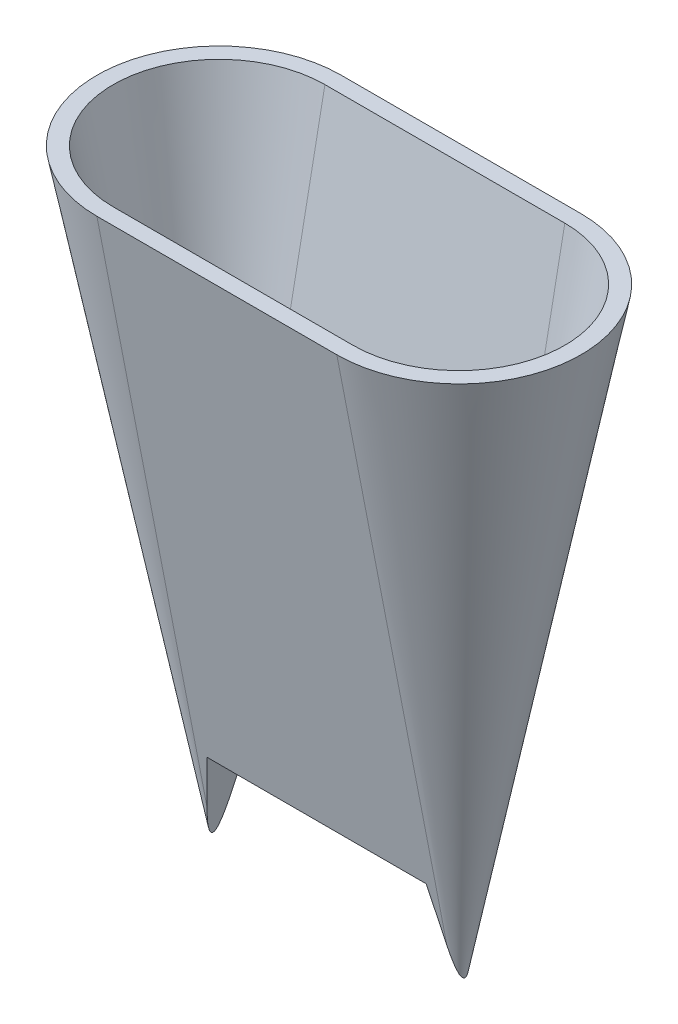
ISO-10303-21;
HEADER;
FILE_DESCRIPTION(('STEP AP214'),'2;1');
FILE_NAME('part.step','',(''),(''),'','','');
FILE_SCHEMA(('AUTOMOTIVE_DESIGN { 1 0 10303 214 1 1 1 1 }'));
ENDSEC;
DATA;
#1=APPLICATION_CONTEXT('core data for automotive mechanical design processes');
#2=APPLICATION_PROTOCOL_DEFINITION('international standard','automotive_design',2000,#1);
#3=PRODUCT_CONTEXT('',#1,'mechanical');
#4=PRODUCT('Part','Part','',(#3));
#5=PRODUCT_RELATED_PRODUCT_CATEGORY('part','',(#4));
#6=PRODUCT_DEFINITION_FORMATION('','',#4);
#7=PRODUCT_DEFINITION_CONTEXT('part definition',#1,'design');
#8=PRODUCT_DEFINITION('design','',#6,#7);
#9=PRODUCT_DEFINITION_SHAPE('','',#8);
#10=(LENGTH_UNIT() NAMED_UNIT(*) SI_UNIT(.MILLI.,.METRE.));
#11=(NAMED_UNIT(*) PLANE_ANGLE_UNIT() SI_UNIT($,.RADIAN.));
#12=(NAMED_UNIT(*) SI_UNIT($,.STERADIAN.) SOLID_ANGLE_UNIT());
#13=UNCERTAINTY_MEASURE_WITH_UNIT(LENGTH_MEASURE(1.E-05),#10,'distance_accuracy_value','');
#14=(GEOMETRIC_REPRESENTATION_CONTEXT(3) GLOBAL_UNCERTAINTY_ASSIGNED_CONTEXT((#13)) GLOBAL_UNIT_ASSIGNED_CONTEXT((#10,
#11,#12)) REPRESENTATION_CONTEXT('',''));
#15=CARTESIAN_POINT('',(0.,0.,0.));
#16=DIRECTION('',(0.,0.,1.));
#17=DIRECTION('',(1.,0.,0.));
#18=AXIS2_PLACEMENT_3D('',#15,#16,#17);
#19=CARTESIAN_POINT('',(-15.,0.,0.));
#20=DIRECTION('',(0.,1.,0.));
#21=DIRECTION('',(0.,0.,1.));
#22=AXIS2_PLACEMENT_3D('',#19,#20,#21);
#23=CONICAL_SURFACE('',#22,7.5,0.191986217719377);
#24=DIRECTION('',(0.,0.981627183447664,-0.190808995376545));
#25=VECTOR('',#24,1.);
#26=CARTESIAN_POINT('',(-15.,0.,-7.5));
#27=LINE('',#26,#25);
#28=CARTESIAN_POINT('',(-15.,40.,-15.2752123655088));
#29=VERTEX_POINT('',#28);
#30=CARTESIAN_POINT('',(-15.,-30.8613850399258,-1.50115443552106));
#31=VERTEX_POINT('',#30);
#32=EDGE_CURVE('E343',#29,#31,#27,.F.);
#33=ORIENTED_EDGE('',*,*,#32,.T.);
#34=CARTESIAN_POINT('',(-14.9998,-30.8603561291226,1.50135442219976));
#35=CARTESIAN_POINT('',(-15.0190712352747,-30.9594980399477,1.48208314362833));
#36=CARTESIAN_POINT('',(-15.038329698687,-31.0585742452367,1.46245909004408));
#37=CARTESIAN_POINT('',(-15.0768168852861,-31.2565736556185,1.42240612971769));
#38=CARTESIAN_POINT('',(-15.0960456072818,-31.3554968545836,1.40197719156499));
#39=CARTESIAN_POINT('',(-15.1537519332705,-31.6523701656958,1.3392566820495));
#40=CARTESIAN_POINT('',(-15.1921761017825,-31.8500453761247,1.29560421439981));
#41=CARTESIAN_POINT('',(-15.2705156890329,-32.2530676143232,1.20150956510338));
#42=CARTESIAN_POINT('',(-15.3104218973465,-32.458367258565,1.15085247219537));
#43=CARTESIAN_POINT('',(-15.3699794504313,-32.7647643074688,1.06929859383519));
#44=CARTESIAN_POINT('',(-15.389770283974,-32.8665793196499,1.04120383318318));
#45=CARTESIAN_POINT('',(-15.4292252524226,-33.0695575360325,0.982679421542151));
#46=CARTESIAN_POINT('',(-15.4488893976455,-33.1707207933096,0.952249963352666));
#47=CARTESIAN_POINT('',(-15.4878158257775,-33.3709799054833,0.88875571223472));
#48=CARTESIAN_POINT('',(-15.5070801310508,-33.4700861645418,0.855725147475472));
#49=CARTESIAN_POINT('',(-15.5453914515757,-33.6671808224052,0.785667271690789));
#50=CARTESIAN_POINT('',(-15.5644379588107,-33.7651666076912,0.748632146875924));
#51=CARTESIAN_POINT('',(-15.5926189917899,-33.9101454540789,0.688931220845984));
#52=CARTESIAN_POINT('',(-15.601918726099,-33.9579884395662,0.668411780415396));
#53=CARTESIAN_POINT('',(-15.620368496395,-34.0529042794363,0.625609477526921));
#54=CARTESIAN_POINT('',(-15.6295185635435,-34.0999772941313,0.603326987933398));
#55=CARTESIAN_POINT('',(-15.647579418861,-34.1928923398867,0.556575317431299));
#56=CARTESIAN_POINT('',(-15.6564908562207,-34.2387377107436,0.532113070371359));
#57=CARTESIAN_POINT('',(-15.6739907328846,-34.3287667715142,0.480223430185622));
#58=CARTESIAN_POINT('',(-15.6825794963089,-34.3729521288805,0.452799125884259));
#59=CARTESIAN_POINT('',(-15.6951288388419,-34.4375128994064,0.40828330964859));
#60=CARTESIAN_POINT('',(-15.69928879819,-34.458914034977,0.392740645365037));
#61=CARTESIAN_POINT('',(-15.7074229136262,-34.5007604312107,0.360314772346504));
#62=CARTESIAN_POINT('',(-15.7113968804938,-34.5212047184189,0.343430243620687));
#63=CARTESIAN_POINT('',(-15.7190411823082,-34.5605312420173,0.308202174131339));
#64=CARTESIAN_POINT('',(-15.7227139513559,-34.5794260007718,0.289873309614169));
#65=CARTESIAN_POINT('',(-15.7296671646166,-34.615197181976,0.251296848263089));
#66=CARTESIAN_POINT('',(-15.7329484285443,-34.6320778214926,0.231053425333127));
#67=CARTESIAN_POINT('',(-15.7381247585097,-34.6587077306039,0.193987307835811));
#68=CARTESIAN_POINT('',(-15.7401560490138,-34.6691578143246,0.17769385359313));
#69=CARTESIAN_POINT('',(-15.7437862311934,-34.6878334826353,0.143790847653814));
#70=CARTESIAN_POINT('',(-15.7453848909728,-34.6960578742234,0.126180596564448));
#71=CARTESIAN_POINT('',(-15.7480197601323,-34.7096131009398,0.0895380092189851));
#72=CARTESIAN_POINT('',(-15.7490483280054,-34.7149046239217,0.0704900672352159));
#73=CARTESIAN_POINT('',(-15.7503664303487,-34.7216856726254,0.0317161378807902));
#74=CARTESIAN_POINT('',(-15.7506575745668,-34.7231834797821,0.0119917228442268));
#75=CARTESIAN_POINT('',(-15.7504703216314,-34.7222201469409,-0.0248433500679373));
#76=CARTESIAN_POINT('',(-15.7500846337885,-34.7202359549999,-0.0419689404773808));
#77=CARTESIAN_POINT('',(-15.7487663608822,-34.7134540288257,-0.0756375389911444));
#78=CARTESIAN_POINT('',(-15.7478330246398,-34.7086524301119,-0.0921797137538846));
#79=CARTESIAN_POINT('',(-15.7450843844251,-34.6945119020569,-0.130297181171212));
#80=CARTESIAN_POINT('',(-15.7430706248146,-34.6841520069654,-0.151473808652895));
#81=CARTESIAN_POINT('',(-15.7384451506752,-34.6603560054056,-0.191924871751388));
#82=CARTESIAN_POINT('',(-15.7358321523146,-34.6469132941961,-0.21119509426829));
#83=CARTESIAN_POINT('',(-15.7277374135341,-34.6052694732945,-0.264148433561012));
#84=CARTESIAN_POINT('',(-15.7217474818391,-34.5744539461375,-0.29567342403224));
#85=CARTESIAN_POINT('',(-15.712226123449,-34.5254708035941,-0.339635894862233));
#86=CARTESIAN_POINT('',(-15.7089547817211,-34.5086412093705,-0.353764514563684));
#87=CARTESIAN_POINT('',(-15.7022712550229,-34.4742574452543,-0.381072652388516));
#88=CARTESIAN_POINT('',(-15.6988591441411,-34.4567036565147,-0.394252660001347));
#89=CARTESIAN_POINT('',(-15.6878613542711,-34.4001249324717,-0.43482001147474));
#90=CARTESIAN_POINT('',(-15.6800779406887,-34.3600827408687,-0.460724552420414));
#91=CARTESIAN_POINT('',(-15.6642032025561,-34.278414293056,-0.509823821483274));
#92=CARTESIAN_POINT('',(-15.6561115870072,-34.2367865397883,-0.533015900022886));
#93=CARTESIAN_POINT('',(-15.6397007048295,-34.1523598699752,-0.577389918868068));
#94=CARTESIAN_POINT('',(-15.631380825778,-34.1095578027885,-0.598565592482726));
#95=CARTESIAN_POINT('',(-15.6145953177553,-34.0232038500803,-0.639274502292302));
#96=CARTESIAN_POINT('',(-15.6061296580903,-33.9796518066532,-0.658807387379938));
#97=CARTESIAN_POINT('',(-15.5803679890253,-33.8471195086062,-0.715884613524773));
#98=CARTESIAN_POINT('',(-15.5629076763217,-33.757293986767,-0.751388160349785));
#99=CARTESIAN_POINT('',(-15.5277663724267,-33.5765076506876,-0.818572942077548));
#100=CARTESIAN_POINT('',(-15.5100858836623,-33.4855494212102,-0.850261568241286));
#101=CARTESIAN_POINT('',(-15.4716328094171,-33.2877255036761,-0.915818414728786));
#102=CARTESIAN_POINT('',(-15.4508294909977,-33.1807017083557,-0.949189255077152));
#103=CARTESIAN_POINT('',(-15.4090635040704,-32.965834332578,-1.01308743902758));
#104=CARTESIAN_POINT('',(-15.3881008159618,-32.8579906512832,-1.04361442653958));
#105=CARTESIAN_POINT('',(-15.3460331719036,-32.6415713841013,-1.10246679035449));
#106=CARTESIAN_POINT('',(-15.3249280610919,-32.5329950015178,-1.13078911197033));
#107=CARTESIAN_POINT('',(-15.2826314778386,-32.3153979442801,-1.18560804098983));
#108=CARTESIAN_POINT('',(-15.2614400025552,-32.2063772550063,-1.21210458779491));
#109=CARTESIAN_POINT('',(-15.2002835212734,-31.8917544336257,-1.28627705799656));
#110=CARTESIAN_POINT('',(-15.1602338082747,-31.6857165217795,-1.33203711548439));
#111=CARTESIAN_POINT('',(-15.1000903371806,-31.3763051860281,-1.39765262854818));
#112=CARTESIAN_POINT('',(-15.0800545237297,-31.2732298614762,-1.41899714707113));
#113=CARTESIAN_POINT('',(-15.0399505231647,-31.0669126643128,-1.46080738160456));
#114=CARTESIAN_POINT('',(-15.0198823376716,-30.9636708000413,-1.48127314028585));
#115=CARTESIAN_POINT('',(-14.9998,-30.8603561291226,-1.50135442219976));
#116=B_SPLINE_CURVE_WITH_KNOTS('',3,(#34,#35,#36,#37,#38,#39,#40,#41,#42,#43,#44,#45,#46,#47,
#48,#49,#50,#51,#52,#53,#54,#55,#56,#57,#58,#59,#60,#61,#62,#63,#64,#65,#66,#67,#68,#69,#70,#71,
#72,#73,#74,#75,#76,#77,#78,#79,#80,#81,#82,#83,#84,#85,#86,#87,#88,#89,#90,#91,#92,#93,#94,#95,
#96,#97,#98,#99,#100,#101,#102,#103,#104,#105,#106,#107,#108,#109,#110,#111,#112,#113,#114,
#115),.UNSPECIFIED.,.F.,.F.,(4,2,2,2,2,2,2,2,2,2,2,2,2,2,2,2,2,2,2,2,2,2,2,2,2,2,2,2,2,2,2,2,2,
2,2,2,2,2,2,2,4),(0.,0.30845863192809,0.616929313380506,1.23504804909283,1.88050601261868,
2.20286129340449,2.52518998265331,2.84382179847025,3.16308695537029,3.32170720356632,
3.48029399463644,3.63839319424917,3.79632909179769,3.87661609213824,3.95698307225618,
4.03661866603624,4.11608448254533,4.17433893438786,4.23262454985843,4.29167361632438,
4.35059367099232,4.40205853612504,4.45359415832359,4.52417144029756,4.59490136615679,
4.72757723520461,4.79422240165465,4.86083292852268,5.00563039359847,5.15056813833216,
5.29594255371339,5.4413479609043,5.735667086207,6.02940647538764,6.37140970762598,
6.71345570604421,7.05596749082456,7.39849063831226,8.04290165459233,8.36435545788473,
8.68579363433026),.UNSPECIFIED.);
#117=CARTESIAN_POINT('',(-15.,-30.8613850399258,1.50115443552106));
#118=VERTEX_POINT('',#117);
#119=EDGE_CURVE('E148',#118,#31,#116,.T.);
#120=ORIENTED_EDGE('',*,*,#119,.F.);
#121=DIRECTION('',(0.,0.981627183447664,0.190808995376545));
#122=VECTOR('',#121,1.);
#123=CARTESIAN_POINT('',(-15.,0.,7.5));
#124=LINE('',#123,#122);
#125=CARTESIAN_POINT('',(-15.,40.,15.2752123655088));
#126=VERTEX_POINT('',#125);
#127=EDGE_CURVE('E11',#126,#118,#124,.F.);
#128=ORIENTED_EDGE('',*,*,#127,.F.);
#129=CARTESIAN_POINT('',(-15.,40.,0.));
#130=DIRECTION('',(0.,1.,0.));
#131=DIRECTION('',(0.,0.,1.));
#132=AXIS2_PLACEMENT_3D('',#129,#130,#131);
#133=CIRCLE('',#132,15.2752123655088);
#134=EDGE_CURVE('E359',#29,#126,#133,.T.);
#135=ORIENTED_EDGE('',*,*,#134,.F.);
#136=EDGE_LOOP('',(#33,#120,#128,#135));
#137=FACE_BOUND('',#136,.T.);
#138=ADVANCED_FACE('F45',(#137),#23,.T.);
#139=CARTESIAN_POINT('',(-15.,0.,7.5));
#140=DIRECTION('',(0.,-0.190808995376545,0.981627183447664));
#141=DIRECTION('',(0.,-0.981627183447664,-0.190808995376545));
#142=AXIS2_PLACEMENT_3D('',#139,#140,#141);
#143=PLANE('',#142);
#144=ORIENTED_EDGE('',*,*,#127,.T.);
#145=DIRECTION('',(0.187427559991896,0.964231206459825,0.187427559991896));
#146=VECTOR('',#145,1.);
#147=CARTESIAN_POINT('',(-12.5878227256113,-18.451808755737,3.91333170990977));
#148=LINE('',#147,#146);
#149=CARTESIAN_POINT('',(-13.7005772177605,-24.1764343471124,2.80057721776053));
#150=VERTEX_POINT('',#149);
#151=EDGE_CURVE('E248',#150,#118,#148,.F.);
#152=ORIENTED_EDGE('',*,*,#151,.F.);
#153=DIRECTION('',(1.,0.,0.));
#154=VECTOR('',#153,1.);
#155=CARTESIAN_POINT('',(-15.,-24.1764343471124,2.80057721776053));
#156=LINE('',#155,#154);
#157=CARTESIAN_POINT('',(13.7005772177605,-24.1764343471124,2.80057721776053));
#158=VERTEX_POINT('',#157);
#159=EDGE_CURVE('E246',#158,#150,#156,.F.);
#160=ORIENTED_EDGE('',*,*,#159,.F.);
#161=DIRECTION('',(0.187427559991896,-0.964231206459825,-0.187427559991896));
#162=VECTOR('',#161,1.);
#163=CARTESIAN_POINT('',(11.5339500182758,-13.0301036868928,4.96720441724524));
#164=LINE('',#163,#162);
#165=CARTESIAN_POINT('',(15.,-30.8613850399258,1.50115443552106));
#166=VERTEX_POINT('',#165);
#167=EDGE_CURVE('E244',#166,#158,#164,.F.);
#168=ORIENTED_EDGE('',*,*,#167,.F.);
#169=DIRECTION('',(0.,0.981627183447664,0.190808995376545));
#170=VECTOR('',#169,1.);
#171=CARTESIAN_POINT('',(15.,0.,7.5));
#172=LINE('',#171,#170);
#173=CARTESIAN_POINT('',(15.,40.,15.2752123655088));
#174=VERTEX_POINT('',#173);
#175=EDGE_CURVE('E49',#174,#166,#172,.F.);
#176=ORIENTED_EDGE('',*,*,#175,.F.);
#177=DIRECTION('',(-1.,0.,0.));
#178=VECTOR('',#177,1.);
#179=CARTESIAN_POINT('',(-15.,40.,15.2752123655088));
#180=LINE('',#179,#178);
#181=EDGE_CURVE('E356',#126,#174,#180,.F.);
#182=ORIENTED_EDGE('',*,*,#181,.F.);
#183=EDGE_LOOP('',(#144,#152,#160,#168,#176,#182));
#184=FACE_BOUND('',#183,.T.);
#185=ADVANCED_FACE('F47',(#184),#143,.T.);
#186=CARTESIAN_POINT('',(15.,0.,0.));
#187=DIRECTION('',(0.,1.,0.));
#188=DIRECTION('',(0.,0.,-1.));
#189=AXIS2_PLACEMENT_3D('',#186,#187,#188);
#190=CONICAL_SURFACE('',#189,7.5,0.191986217719377);
#191=ORIENTED_EDGE('',*,*,#175,.T.);
#192=CARTESIAN_POINT('',(14.9998,-30.8603561291226,-1.50135442219976));
#193=CARTESIAN_POINT('',(15.0190712352747,-30.9594980399477,-1.48208314362834));
#194=CARTESIAN_POINT('',(15.0383296986869,-31.0585742452366,-1.46245909004409));
#195=CARTESIAN_POINT('',(15.0768168852861,-31.2565736556185,-1.4224061297177));
#196=CARTESIAN_POINT('',(15.0960456072818,-31.3554968545836,-1.40197719156499));
#197=CARTESIAN_POINT('',(15.1537519332705,-31.6523701656958,-1.3392566820495));
#198=CARTESIAN_POINT('',(15.1921761017825,-31.8500453761246,-1.29560421439982));
#199=CARTESIAN_POINT('',(15.2705156890329,-32.2530676143231,-1.20150956510338));
#200=CARTESIAN_POINT('',(15.3104218973465,-32.458367258565,-1.15085247219537));
#201=CARTESIAN_POINT('',(15.3699794504313,-32.7647643074688,-1.06929859383519));
#202=CARTESIAN_POINT('',(15.389770283974,-32.8665793196499,-1.04120383318319));
#203=CARTESIAN_POINT('',(15.4292252524226,-33.0695575360325,-0.982679421542153));
#204=CARTESIAN_POINT('',(15.4488893976455,-33.1707207933096,-0.952249963352668));
#205=CARTESIAN_POINT('',(15.4878158257775,-33.3709799054833,-0.888755712234722));
#206=CARTESIAN_POINT('',(15.5070801310508,-33.4700861645418,-0.855725147475473));
#207=CARTESIAN_POINT('',(15.5453914515757,-33.6671808224052,-0.785667271690788));
#208=CARTESIAN_POINT('',(15.5644379588107,-33.7651666076912,-0.748632146875922));
#209=CARTESIAN_POINT('',(15.5926189917899,-33.9101454540789,-0.68893122084598));
#210=CARTESIAN_POINT('',(15.601918726099,-33.9579884395662,-0.668411780415391));
#211=CARTESIAN_POINT('',(15.620368496395,-34.0529042794363,-0.625609477526916));
#212=CARTESIAN_POINT('',(15.6295185635435,-34.0999772941313,-0.603326987933394));
#213=CARTESIAN_POINT('',(15.647579418861,-34.1928923398867,-0.556575317431292));
#214=CARTESIAN_POINT('',(15.6564908562207,-34.2387377107436,-0.532113070371351));
#215=CARTESIAN_POINT('',(15.6739907328846,-34.3287667715142,-0.480223430185614));
#216=CARTESIAN_POINT('',(15.6825794963089,-34.3729521288805,-0.452799125884254));
#217=CARTESIAN_POINT('',(15.6951288388419,-34.4375128994064,-0.408283309648587));
#218=CARTESIAN_POINT('',(15.69928879819,-34.458914034977,-0.392740645365034));
#219=CARTESIAN_POINT('',(15.7074229136262,-34.5007604312107,-0.360314772346501));
#220=CARTESIAN_POINT('',(15.7113968804938,-34.5212047184189,-0.343430243620685));
#221=CARTESIAN_POINT('',(15.7190411823082,-34.5605312420173,-0.308202174131339));
#222=CARTESIAN_POINT('',(15.7227139513559,-34.5794260007718,-0.289873309614169));
#223=CARTESIAN_POINT('',(15.7296671646166,-34.615197181976,-0.25129684826309));
#224=CARTESIAN_POINT('',(15.7329484285443,-34.6320778214926,-0.231053425333129));
#225=CARTESIAN_POINT('',(15.7381247585097,-34.6587077306039,-0.193987307835813));
#226=CARTESIAN_POINT('',(15.7401560490138,-34.6691578143246,-0.177693853593132));
#227=CARTESIAN_POINT('',(15.7437862311934,-34.6878334826353,-0.143790847653814));
#228=CARTESIAN_POINT('',(15.7453848909728,-34.6960578742234,-0.126180596564448));
#229=CARTESIAN_POINT('',(15.7480197601323,-34.7096131009398,-0.0895380092189818));
#230=CARTESIAN_POINT('',(15.7490483280054,-34.7149046239216,-0.0704900672352112));
#231=CARTESIAN_POINT('',(15.7503664303487,-34.7216856726254,-0.031716137880784));
#232=CARTESIAN_POINT('',(15.7506575745668,-34.7231834797821,-0.0119917228442207));
#233=CARTESIAN_POINT('',(15.7504703216314,-34.7222201469409,0.0248433500679432));
#234=CARTESIAN_POINT('',(15.7500846337885,-34.7202359549999,0.0419689404773865));
#235=CARTESIAN_POINT('',(15.7487663608822,-34.7134540288257,0.0756375389911489));
#236=CARTESIAN_POINT('',(15.7478330246398,-34.7086524301119,0.0921797137538882));
#237=CARTESIAN_POINT('',(15.7450843844251,-34.6945119020569,0.130297181171215));
#238=CARTESIAN_POINT('',(15.7430706248146,-34.6841520069654,0.151473808652899));
#239=CARTESIAN_POINT('',(15.7384451506752,-34.6603560054056,0.191924871751392));
#240=CARTESIAN_POINT('',(15.7358321523146,-34.6469132941961,0.211195094268294));
#241=CARTESIAN_POINT('',(15.7277374135341,-34.6052694732945,0.264148433561018));
#242=CARTESIAN_POINT('',(15.7217474818391,-34.5744539461375,0.295673424032248));
#243=CARTESIAN_POINT('',(15.712226123449,-34.5254708035941,0.339635894862242));
#244=CARTESIAN_POINT('',(15.7089547817211,-34.5086412093705,0.353764514563691));
#245=CARTESIAN_POINT('',(15.7022712550229,-34.4742574452543,0.381072652388523));
#246=CARTESIAN_POINT('',(15.6988591441411,-34.4567036565147,0.394252660001354));
#247=CARTESIAN_POINT('',(15.6878613542711,-34.4001249324717,0.434820011474751));
#248=CARTESIAN_POINT('',(15.6800779406887,-34.3600827408687,0.460724552420427));
#249=CARTESIAN_POINT('',(15.6642032025561,-34.2784142930559,0.509823821483289));
#250=CARTESIAN_POINT('',(15.6561115870072,-34.2367865397883,0.533015900022899));
#251=CARTESIAN_POINT('',(15.6397007048294,-34.1523598699751,0.577389918868081));
#252=CARTESIAN_POINT('',(15.631380825778,-34.1095578027885,0.598565592482739));
#253=CARTESIAN_POINT('',(15.6145953177553,-34.0232038500803,0.639274502292317));
#254=CARTESIAN_POINT('',(15.6061296580903,-33.9796518066531,0.658807387379953));
#255=CARTESIAN_POINT('',(15.5803679890252,-33.8471195086062,0.715884613524789));
#256=CARTESIAN_POINT('',(15.5629076763217,-33.757293986767,0.751388160349802));
#257=CARTESIAN_POINT('',(15.5277663724267,-33.5765076506875,0.818572942077567));
#258=CARTESIAN_POINT('',(15.5100858836622,-33.4855494212101,0.850261568241306));
#259=CARTESIAN_POINT('',(15.4716328094171,-33.287725503676,0.915818414728806));
#260=CARTESIAN_POINT('',(15.4508294909977,-33.1807017083557,0.949189255077171));
#261=CARTESIAN_POINT('',(15.4090635040704,-32.965834332578,1.0130874390276));
#262=CARTESIAN_POINT('',(15.3881008159618,-32.8579906512831,1.04361442653959));
#263=CARTESIAN_POINT('',(15.3460331719036,-32.6415713841013,1.1024667903545));
#264=CARTESIAN_POINT('',(15.3249280610919,-32.5329950015178,1.13078911197033));
#265=CARTESIAN_POINT('',(15.2826314778386,-32.3153979442801,1.18560804098984));
#266=CARTESIAN_POINT('',(15.2614400025552,-32.2063772550062,1.21210458779492));
#267=CARTESIAN_POINT('',(15.2002835212734,-31.8917544336256,1.28627705799657));
#268=CARTESIAN_POINT('',(15.1602338082747,-31.6857165217795,1.3320371154844));
#269=CARTESIAN_POINT('',(15.1000903371806,-31.3763051860281,1.39765262854819));
#270=CARTESIAN_POINT('',(15.0800545237297,-31.2732298614762,1.41899714707114));
#271=CARTESIAN_POINT('',(15.0399505231647,-31.0669126643127,1.46080738160456));
#272=CARTESIAN_POINT('',(15.0198823376716,-30.9636708000412,1.48127314028586));
#273=CARTESIAN_POINT('',(14.9998,-30.8603561291225,1.50135442219976));
#274=B_SPLINE_CURVE_WITH_KNOTS('',3,(#192,#193,#194,#195,#196,#197,#198,#199,#200,#201,#202,
#203,#204,#205,#206,#207,#208,#209,#210,#211,#212,#213,#214,#215,#216,#217,#218,#219,#220,#221,
#222,#223,#224,#225,#226,#227,#228,#229,#230,#231,#232,#233,#234,#235,#236,#237,#238,#239,#240,
#241,#242,#243,#244,#245,#246,#247,#248,#249,#250,#251,#252,#253,#254,#255,#256,#257,#258,#259,
#260,#261,#262,#263,#264,#265,#266,#267,#268,#269,#270,#271,#272,#273),.UNSPECIFIED.,.F.,.F.,(4,
2,2,2,2,2,2,2,2,2,2,2,2,2,2,2,2,2,2,2,2,2,2,2,2,2,2,2,2,2,2,2,2,2,2,2,2,2,2,2,4),(0.,
0.308458631928083,0.616929313380488,1.23504804909281,1.88050601261867,2.20286129340449,
2.52518998265331,2.84382179847025,3.16308695537031,3.32170720356634,3.48029399463646,
3.6383931942492,3.79632909179771,3.87661609213826,3.95698307225619,4.03661866603624,
4.11608448254533,4.17433893438786,4.23262454985844,4.29167361632439,4.35059367099233,
4.40205853612505,4.45359415832361,4.52417144029757,4.5949013661568,4.72757723520463,
4.79422240165467,4.8608329285227,5.0056303935985,5.1505681383322,5.29594255371343,
5.44134796090436,5.73566708620706,6.02940647538772,6.37140970762605,6.71345570604427,
7.0559674908246,7.39849063831229,8.04290165459237,8.36435545788476,8.68579363433028),.UNSPECIFIED.);
#275=CARTESIAN_POINT('',(15.,-30.8613850399258,-1.50115443552106));
#276=VERTEX_POINT('',#275);
#277=EDGE_CURVE('E240',#276,#166,#274,.T.);
#278=ORIENTED_EDGE('',*,*,#277,.F.);
#279=DIRECTION('',(0.,0.981627183447664,-0.190808995376545));
#280=VECTOR('',#279,1.);
#281=CARTESIAN_POINT('',(15.,0.,-7.5));
#282=LINE('',#281,#280);
#283=CARTESIAN_POINT('',(15.,40.,-15.2752123655088));
#284=VERTEX_POINT('',#283);
#285=EDGE_CURVE('E243',#284,#276,#282,.F.);
#286=ORIENTED_EDGE('',*,*,#285,.F.);
#287=CARTESIAN_POINT('',(15.,40.,0.));
#288=DIRECTION('',(0.,1.,0.));
#289=DIRECTION('',(0.,0.,1.));
#290=AXIS2_PLACEMENT_3D('',#287,#288,#289);
#291=CIRCLE('',#290,15.2752123655088);
#292=EDGE_CURVE('E241',#174,#284,#291,.T.);
#293=ORIENTED_EDGE('',*,*,#292,.F.);
#294=EDGE_LOOP('',(#191,#278,#286,#293));
#295=FACE_BOUND('',#294,.T.);
#296=ADVANCED_FACE('F227',(#295),#190,.T.);
#297=CARTESIAN_POINT('',(-15.,0.,-7.5));
#298=DIRECTION('',(0.,-0.190808995376545,-0.981627183447664));
#299=DIRECTION('',(0.,0.981627183447664,-0.190808995376545));
#300=AXIS2_PLACEMENT_3D('',#297,#298,#299);
#301=PLANE('',#300);
#302=ORIENTED_EDGE('',*,*,#285,.T.);
#303=DIRECTION('',(-0.187427559991896,0.964231206459825,-0.187427559991896));
#304=VECTOR('',#303,1.);
#305=CARTESIAN_POINT('',(12.5878227256113,-18.451808755737,-3.91333170990977));
#306=LINE('',#305,#304);
#307=CARTESIAN_POINT('',(13.7005772177605,-24.1764343471124,-2.80057721776053));
#308=VERTEX_POINT('',#307);
#309=EDGE_CURVE('E191',#308,#276,#306,.F.);
#310=ORIENTED_EDGE('',*,*,#309,.F.);
#311=DIRECTION('',(-1.,0.,0.));
#312=VECTOR('',#311,1.);
#313=CARTESIAN_POINT('',(15.,-24.1764343471124,-2.80057721776053));
#314=LINE('',#313,#312);
#315=CARTESIAN_POINT('',(-13.7005772177605,-24.1764343471124,-2.80057721776053));
#316=VERTEX_POINT('',#315);
#317=EDGE_CURVE('E144',#316,#308,#314,.F.);
#318=ORIENTED_EDGE('',*,*,#317,.F.);
#319=DIRECTION('',(-0.187427559991896,-0.964231206459825,0.187427559991896));
#320=VECTOR('',#319,1.);
#321=CARTESIAN_POINT('',(-11.5339500182758,-13.0301036868928,-4.96720441724524));
#322=LINE('',#321,#320);
#323=EDGE_CURVE('E251',#31,#316,#322,.F.);
#324=ORIENTED_EDGE('',*,*,#323,.F.);
#325=ORIENTED_EDGE('',*,*,#32,.F.);
#326=DIRECTION('',(1.,0.,0.));
#327=VECTOR('',#326,1.);
#328=CARTESIAN_POINT('',(-15.,40.,-15.2752123655088));
#329=LINE('',#328,#327);
#330=EDGE_CURVE('E347',#284,#29,#329,.F.);
#331=ORIENTED_EDGE('',*,*,#330,.F.);
#332=EDGE_LOOP('',(#302,#310,#318,#324,#325,#331));
#333=FACE_BOUND('',#332,.T.);
#334=ADVANCED_FACE('F221',(#333),#301,.T.);
#335=CARTESIAN_POINT('',(-15.,40.,0.));
#336=DIRECTION('',(0.,1.,0.));
#337=DIRECTION('',(0.,0.,1.));
#338=AXIS2_PLACEMENT_3D('',#335,#336,#337);
#339=PLANE('',#338);
#340=CARTESIAN_POINT('',(-15.,40.,0.));
#341=DIRECTION('',(0.,1.,0.));
#342=DIRECTION('',(0.,0.,1.));
#343=AXIS2_PLACEMENT_3D('',#340,#341,#342);
#344=CIRCLE('',#343,13.2377789755983);
#345=CARTESIAN_POINT('',(-15.,40.,-13.2377789755983));
#346=VERTEX_POINT('',#345);
#347=CARTESIAN_POINT('',(-15.,40.,13.2377789755983));
#348=VERTEX_POINT('',#347);
#349=EDGE_CURVE('E374',#346,#348,#344,.T.);
#350=ORIENTED_EDGE('',*,*,#349,.F.);
#351=DIRECTION('',(1.,0.,0.));
#352=VECTOR('',#351,1.);
#353=CARTESIAN_POINT('',(-15.,40.,-13.2377789755983));
#354=LINE('',#353,#352);
#355=CARTESIAN_POINT('',(15.,40.,-13.2377789755983));
#356=VERTEX_POINT('',#355);
#357=EDGE_CURVE('E364',#356,#346,#354,.F.);
#358=ORIENTED_EDGE('',*,*,#357,.F.);
#359=CARTESIAN_POINT('',(15.,40.,0.));
#360=DIRECTION('',(0.,1.,0.));
#361=DIRECTION('',(0.,0.,1.));
#362=AXIS2_PLACEMENT_3D('',#359,#360,#361);
#363=CIRCLE('',#362,13.2377789755983);
#364=CARTESIAN_POINT('',(15.,40.,13.2377789755983));
#365=VERTEX_POINT('',#364);
#366=EDGE_CURVE('E368',#365,#356,#363,.T.);
#367=ORIENTED_EDGE('',*,*,#366,.F.);
#368=DIRECTION('',(-1.,0.,0.));
#369=VECTOR('',#368,1.);
#370=CARTESIAN_POINT('',(-15.,40.,13.2377789755983));
#371=LINE('',#370,#369);
#372=EDGE_CURVE('E371',#348,#365,#371,.F.);
#373=ORIENTED_EDGE('',*,*,#372,.F.);
#374=EDGE_LOOP('',(#350,#358,#367,#373));
#375=FACE_BOUND('',#374,.T.);
#376=ORIENTED_EDGE('',*,*,#134,.T.);
#377=ORIENTED_EDGE('',*,*,#181,.T.);
#378=ORIENTED_EDGE('',*,*,#292,.T.);
#379=ORIENTED_EDGE('',*,*,#330,.T.);
#380=EDGE_LOOP('',(#376,#377,#378,#379));
#381=FACE_BOUND('',#380,.T.);
#382=ADVANCED_FACE('F208',(#375,#381),#339,.T.);
#383=CARTESIAN_POINT('',(-15.,0.38161799075309,0.));
#384=DIRECTION('',(0.,1.,0.));
#385=DIRECTION('',(0.,0.,1.));
#386=AXIS2_PLACEMENT_3D('',#383,#384,#385);
#387=CONICAL_SURFACE('',#386,5.53674563310467,0.191986217719377);
#388=DIRECTION('',(0.,0.981627183447664,-0.190808995376545));
#389=VECTOR('',#388,1.);
#390=CARTESIAN_POINT('',(-15.,0.38161799075309,-5.53674563310467));
#391=LINE('',#390,#389);
#392=CARTESIAN_POINT('',(-15.,-18.,-1.96372104561063));
#393=VERTEX_POINT('',#392);
#394=EDGE_CURVE('E367',#346,#393,#391,.F.);
#395=ORIENTED_EDGE('',*,*,#394,.F.);
#396=ORIENTED_EDGE('',*,*,#349,.T.);
#397=DIRECTION('',(0.,-0.981627183447664,-0.190808995376545));
#398=VECTOR('',#397,1.);
#399=CARTESIAN_POINT('',(-15.,0.38161799075309,5.53674563310467));
#400=LINE('',#399,#398);
#401=CARTESIAN_POINT('',(-15.,-18.,1.96372104561063));
#402=VERTEX_POINT('',#401);
#403=EDGE_CURVE('E363',#348,#402,#400,.T.);
#404=ORIENTED_EDGE('',*,*,#403,.T.);
#405=CARTESIAN_POINT('',(-15.,-18.,0.));
#406=DIRECTION('',(0.,1.,0.));
#407=DIRECTION('',(0.,0.,1.));
#408=AXIS2_PLACEMENT_3D('',#405,#406,#407);
#409=CIRCLE('',#408,1.96372104561063);
#410=EDGE_CURVE('E382',#393,#402,#409,.T.);
#411=ORIENTED_EDGE('',*,*,#410,.F.);
#412=EDGE_LOOP('',(#395,#396,#404,#411));
#413=FACE_BOUND('',#412,.T.);
#414=ADVANCED_FACE('F204',(#413),#387,.F.);
#415=CARTESIAN_POINT('',(-15.,0.38161799075309,5.53674563310467));
#416=DIRECTION('',(0.,-0.190808995376545,0.981627183447664));
#417=DIRECTION('',(0.,-0.981627183447664,-0.190808995376545));
#418=AXIS2_PLACEMENT_3D('',#415,#416,#417);
#419=PLANE('',#418);
#420=ORIENTED_EDGE('',*,*,#403,.F.);
#421=ORIENTED_EDGE('',*,*,#372,.T.);
#422=DIRECTION('',(0.,0.981627183447664,0.190808995376545));
#423=VECTOR('',#422,1.);
#424=CARTESIAN_POINT('',(15.,0.38161799075309,5.53674563310467));
#425=LINE('',#424,#423);
#426=CARTESIAN_POINT('',(15.,-18.,1.96372104561063));
#427=VERTEX_POINT('',#426);
#428=EDGE_CURVE('E393',#365,#427,#425,.F.);
#429=ORIENTED_EDGE('',*,*,#428,.T.);
#430=DIRECTION('',(-1.,0.,0.));
#431=VECTOR('',#430,1.);
#432=CARTESIAN_POINT('',(-15.,-18.,1.96372104561063));
#433=LINE('',#432,#431);
#434=EDGE_CURVE('E378',#402,#427,#433,.F.);
#435=ORIENTED_EDGE('',*,*,#434,.F.);
#436=EDGE_LOOP('',(#420,#421,#429,#435));
#437=FACE_BOUND('',#436,.T.);
#438=ADVANCED_FACE('F207',(#437),#419,.F.);
#439=CARTESIAN_POINT('',(15.,0.38161799075309,0.));
#440=DIRECTION('',(0.,1.,0.));
#441=DIRECTION('',(0.,0.,-1.));
#442=AXIS2_PLACEMENT_3D('',#439,#440,#441);
#443=CONICAL_SURFACE('',#442,5.53674563310467,0.191986217719377);
#444=ORIENTED_EDGE('',*,*,#428,.F.);
#445=ORIENTED_EDGE('',*,*,#366,.T.);
#446=DIRECTION('',(0.,0.981627183447664,-0.190808995376545));
#447=VECTOR('',#446,1.);
#448=CARTESIAN_POINT('',(15.,0.38161799075309,-5.53674563310467));
#449=LINE('',#448,#447);
#450=CARTESIAN_POINT('',(15.,-18.,-1.96372104561063));
#451=VERTEX_POINT('',#450);
#452=EDGE_CURVE('E62',#356,#451,#449,.F.);
#453=ORIENTED_EDGE('',*,*,#452,.T.);
#454=CARTESIAN_POINT('',(15.,-18.,0.));
#455=DIRECTION('',(0.,1.,0.));
#456=DIRECTION('',(0.,0.,1.));
#457=AXIS2_PLACEMENT_3D('',#454,#455,#456);
#458=CIRCLE('',#457,1.96372104561063);
#459=EDGE_CURVE('E69',#427,#451,#458,.T.);
#460=ORIENTED_EDGE('',*,*,#459,.F.);
#461=EDGE_LOOP('',(#444,#445,#453,#460));
#462=FACE_BOUND('',#461,.T.);
#463=ADVANCED_FACE('F212',(#462),#443,.F.);
#464=CARTESIAN_POINT('',(-15.,0.38161799075309,-5.53674563310467));
#465=DIRECTION('',(0.,-0.190808995376545,-0.981627183447664));
#466=DIRECTION('',(0.,0.981627183447664,-0.190808995376545));
#467=AXIS2_PLACEMENT_3D('',#464,#465,#466);
#468=PLANE('',#467);
#469=ORIENTED_EDGE('',*,*,#452,.F.);
#470=ORIENTED_EDGE('',*,*,#357,.T.);
#471=ORIENTED_EDGE('',*,*,#394,.T.);
#472=DIRECTION('',(1.,0.,0.));
#473=VECTOR('',#472,1.);
#474=CARTESIAN_POINT('',(-15.,-18.,-1.96372104561063));
#475=LINE('',#474,#473);
#476=EDGE_CURVE('E377',#451,#393,#475,.F.);
#477=ORIENTED_EDGE('',*,*,#476,.F.);
#478=EDGE_LOOP('',(#469,#470,#471,#477));
#479=FACE_BOUND('',#478,.T.);
#480=ADVANCED_FACE('F216',(#479),#468,.F.);
#481=CARTESIAN_POINT('',(-15.,-18.,0.));
#482=DIRECTION('',(0.,-1.,0.));
#483=DIRECTION('',(0.,0.,-1.));
#484=AXIS2_PLACEMENT_3D('',#481,#482,#483);
#485=PLANE('',#484);
#486=DIRECTION('',(1.,0.,0.));
#487=VECTOR('',#486,1.);
#488=CARTESIAN_POINT('',(-12.5,-18.,-1.6));
#489=LINE('',#488,#487);
#490=CARTESIAN_POINT('',(-12.5,-18.,-1.6));
#491=VERTEX_POINT('',#490);
#492=CARTESIAN_POINT('',(12.5,-18.,-1.6));
#493=VERTEX_POINT('',#492);
#494=EDGE_CURVE('E142',#491,#493,#489,.T.);
#495=ORIENTED_EDGE('',*,*,#494,.T.);
#496=DIRECTION('',(0.,0.,1.));
#497=VECTOR('',#496,1.);
#498=CARTESIAN_POINT('',(12.5,-18.,1.6));
#499=LINE('',#498,#497);
#500=CARTESIAN_POINT('',(12.5,-18.,1.6));
#501=VERTEX_POINT('',#500);
#502=EDGE_CURVE('E152',#493,#501,#499,.T.);
#503=ORIENTED_EDGE('',*,*,#502,.T.);
#504=DIRECTION('',(-1.,0.,0.));
#505=VECTOR('',#504,1.);
#506=CARTESIAN_POINT('',(-12.5,-18.,1.6));
#507=LINE('',#506,#505);
#508=CARTESIAN_POINT('',(-12.5,-18.,1.6));
#509=VERTEX_POINT('',#508);
#510=EDGE_CURVE('E161',#501,#509,#507,.T.);
#511=ORIENTED_EDGE('',*,*,#510,.T.);
#512=DIRECTION('',(0.,0.,-1.));
#513=VECTOR('',#512,1.);
#514=CARTESIAN_POINT('',(-12.5,-18.,1.6));
#515=LINE('',#514,#513);
#516=EDGE_CURVE('E166',#509,#491,#515,.T.);
#517=ORIENTED_EDGE('',*,*,#516,.T.);
#518=EDGE_LOOP('',(#495,#503,#511,#517));
#519=FACE_BOUND('',#518,.T.);
#520=ORIENTED_EDGE('',*,*,#459,.T.);
#521=ORIENTED_EDGE('',*,*,#476,.T.);
#522=ORIENTED_EDGE('',*,*,#410,.T.);
#523=ORIENTED_EDGE('',*,*,#434,.T.);
#524=EDGE_LOOP('',(#520,#521,#522,#523));
#525=FACE_BOUND('',#524,.T.);
#526=ADVANCED_FACE('F163',(#519,#525),#485,.F.);
#527=CARTESIAN_POINT('',(-12.5,-18.,-1.6));
#528=DIRECTION('',(0.,-0.190808995376545,0.981627183447664));
#529=DIRECTION('',(0.,-0.981627183447664,-0.190808995376545));
#530=AXIS2_PLACEMENT_3D('',#527,#528,#529);
#531=PLANE('',#530);
#532=DIRECTION('',(0.187427559991896,0.964231206459825,0.187427559991896));
#533=VECTOR('',#532,1.);
#534=CARTESIAN_POINT('',(-12.5,-18.,-1.6));
#535=LINE('',#534,#533);
#536=EDGE_CURVE('E174',#316,#491,#535,.T.);
#537=ORIENTED_EDGE('',*,*,#536,.F.);
#538=ORIENTED_EDGE('',*,*,#317,.T.);
#539=DIRECTION('',(-0.187427559991896,0.964231206459825,0.187427559991896));
#540=VECTOR('',#539,1.);
#541=CARTESIAN_POINT('',(12.3875869112176,-17.4216847926566,-1.48758691121755));
#542=LINE('',#541,#540);
#543=EDGE_CURVE('E137',#308,#493,#542,.T.);
#544=ORIENTED_EDGE('',*,*,#543,.T.);
#545=ORIENTED_EDGE('',*,*,#494,.F.);
#546=EDGE_LOOP('',(#537,#538,#544,#545));
#547=FACE_BOUND('',#546,.T.);
#548=ADVANCED_FACE('F140',(#547),#531,.T.);
#549=CARTESIAN_POINT('',(12.5,-18.,1.6));
#550=DIRECTION('',(-0.981627183447664,-0.190808995376545,0.));
#551=DIRECTION('',(0.190808995376545,-0.981627183447664,0.));
#552=AXIS2_PLACEMENT_3D('',#549,#550,#551);
#553=PLANE('',#552);
#554=ORIENTED_EDGE('',*,*,#277,.T.);
#555=ORIENTED_EDGE('',*,*,#167,.T.);
#556=DIRECTION('',(-0.187427559991896,0.964231206459825,-0.187427559991896));
#557=VECTOR('',#556,1.);
#558=CARTESIAN_POINT('',(11.6217727438871,-13.4819124426298,0.721772743887106));
#559=LINE('',#558,#557);
#560=EDGE_CURVE('E149',#158,#501,#559,.T.);
#561=ORIENTED_EDGE('',*,*,#560,.T.);
#562=ORIENTED_EDGE('',*,*,#502,.F.);
#563=ORIENTED_EDGE('',*,*,#543,.F.);
#564=ORIENTED_EDGE('',*,*,#309,.T.);
#565=EDGE_LOOP('',(#554,#555,#561,#562,#563,#564));
#566=FACE_BOUND('',#565,.T.);
#567=ADVANCED_FACE('F154',(#566),#553,.T.);
#568=CARTESIAN_POINT('',(-12.5,-18.,1.6));
#569=DIRECTION('',(0.,-0.190808995376545,-0.981627183447664));
#570=DIRECTION('',(0.,0.981627183447664,-0.190808995376545));
#571=AXIS2_PLACEMENT_3D('',#568,#569,#570);
#572=PLANE('',#571);
#573=ORIENTED_EDGE('',*,*,#560,.F.);
#574=ORIENTED_EDGE('',*,*,#159,.T.);
#575=DIRECTION('',(0.187427559991896,0.964231206459825,-0.187427559991896));
#576=VECTOR('',#575,1.);
#577=CARTESIAN_POINT('',(-12.5,-18.,1.6));
#578=LINE('',#577,#576);
#579=EDGE_CURVE('E176',#150,#509,#578,.T.);
#580=ORIENTED_EDGE('',*,*,#579,.T.);
#581=ORIENTED_EDGE('',*,*,#510,.F.);
#582=EDGE_LOOP('',(#573,#574,#580,#581));
#583=FACE_BOUND('',#582,.T.);
#584=ADVANCED_FACE('F201',(#583),#572,.T.);
#585=CARTESIAN_POINT('',(-12.5,-18.,1.6));
#586=DIRECTION('',(0.981627183447664,-0.190808995376545,0.));
#587=DIRECTION('',(0.190808995376545,0.981627183447664,0.));
#588=AXIS2_PLACEMENT_3D('',#585,#586,#587);
#589=PLANE('',#588);
#590=ORIENTED_EDGE('',*,*,#579,.F.);
#591=ORIENTED_EDGE('',*,*,#151,.T.);
#592=ORIENTED_EDGE('',*,*,#119,.T.);
#593=ORIENTED_EDGE('',*,*,#323,.T.);
#594=ORIENTED_EDGE('',*,*,#536,.T.);
#595=ORIENTED_EDGE('',*,*,#516,.F.);
#596=EDGE_LOOP('',(#590,#591,#592,#593,#594,#595));
#597=FACE_BOUND('',#596,.T.);
#598=ADVANCED_FACE('F196',(#597),#589,.T.);
#599=CLOSED_SHELL('',(#138,#185,#296,#334,#382,#414,#438,#463,#480,#526,#548,#567,#584,#598));
#600=MANIFOLD_SOLID_BREP('B2',#599);
#601=ADVANCED_BREP_SHAPE_REPRESENTATION('',(#18,#600),#14);
#602=SHAPE_DEFINITION_REPRESENTATION(#9,#601);
ENDSEC;
END-ISO-10303-21;
